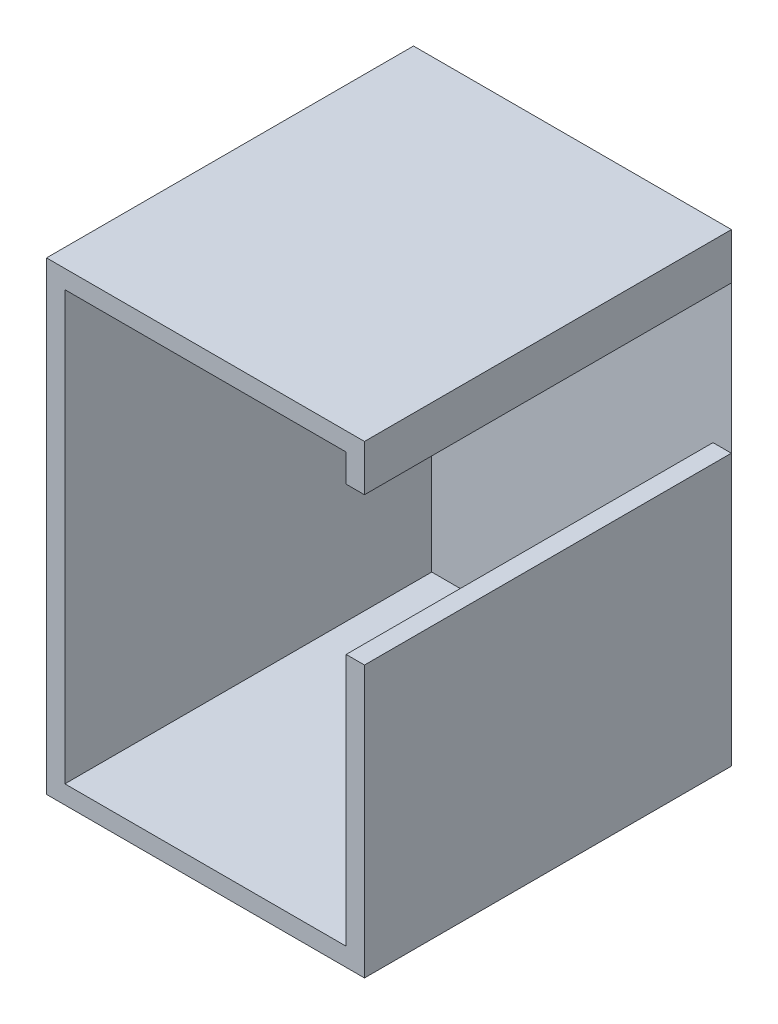
ISO-10303-21;
HEADER;
FILE_DESCRIPTION(('STEP AP214'),'2;1');
FILE_NAME('part.step','',(''),(''),'','','');
FILE_SCHEMA(('AUTOMOTIVE_DESIGN { 1 0 10303 214 1 1 1 1 }'));
ENDSEC;
DATA;
#1=APPLICATION_CONTEXT('core data for automotive mechanical design processes');
#2=APPLICATION_PROTOCOL_DEFINITION('international standard','automotive_design',2000,#1);
#3=PRODUCT_CONTEXT('',#1,'mechanical');
#4=PRODUCT('Part','Part','',(#3));
#5=PRODUCT_RELATED_PRODUCT_CATEGORY('part','',(#4));
#6=PRODUCT_DEFINITION_FORMATION('','',#4);
#7=PRODUCT_DEFINITION_CONTEXT('part definition',#1,'design');
#8=PRODUCT_DEFINITION('design','',#6,#7);
#9=PRODUCT_DEFINITION_SHAPE('','',#8);
#10=(LENGTH_UNIT() NAMED_UNIT(*) SI_UNIT(.MILLI.,.METRE.));
#11=(NAMED_UNIT(*) PLANE_ANGLE_UNIT() SI_UNIT($,.RADIAN.));
#12=(NAMED_UNIT(*) SI_UNIT($,.STERADIAN.) SOLID_ANGLE_UNIT());
#13=UNCERTAINTY_MEASURE_WITH_UNIT(LENGTH_MEASURE(1.E-05),#10,'distance_accuracy_value','');
#14=(GEOMETRIC_REPRESENTATION_CONTEXT(3) GLOBAL_UNCERTAINTY_ASSIGNED_CONTEXT((#13)) GLOBAL_UNIT_ASSIGNED_CONTEXT((#10,
#11,#12)) REPRESENTATION_CONTEXT('',''));
#15=CARTESIAN_POINT('',(0.,0.,0.));
#16=DIRECTION('',(0.,0.,1.));
#17=DIRECTION('',(1.,0.,0.));
#18=AXIS2_PLACEMENT_3D('',#15,#16,#17);
#19=CARTESIAN_POINT('',(0.,0.,3000.));
#20=DIRECTION('',(1.,0.,0.));
#21=DIRECTION('',(0.,1.,0.));
#22=AXIS2_PLACEMENT_3D('',#19,#20,#21);
#23=PLANE('',#22);
#24=DIRECTION('',(0.,-1.,0.));
#25=VECTOR('',#24,1.);
#26=CARTESIAN_POINT('',(0.,0.,0.));
#27=LINE('',#26,#25);
#28=CARTESIAN_POINT('',(0.,0.,0.));
#29=VERTEX_POINT('',#28);
#30=CARTESIAN_POINT('',(0.,-227.614779849119,0.));
#31=VERTEX_POINT('',#30);
#32=EDGE_CURVE('E151',#29,#31,#27,.T.);
#33=ORIENTED_EDGE('',*,*,#32,.T.);
#34=DIRECTION('',(0.,0.,-1.));
#35=VECTOR('',#34,1.);
#36=CARTESIAN_POINT('',(0.,-227.614779849119,3000.));
#37=LINE('',#36,#35);
#38=CARTESIAN_POINT('',(0.,-227.614779849119,3000.));
#39=VERTEX_POINT('',#38);
#40=EDGE_CURVE('E11',#39,#31,#37,.T.);
#41=ORIENTED_EDGE('',*,*,#40,.F.);
#42=DIRECTION('',(0.,-1.,0.));
#43=VECTOR('',#42,1.);
#44=CARTESIAN_POINT('',(0.,0.,3000.));
#45=LINE('',#44,#43);
#46=CARTESIAN_POINT('',(0.,0.,3000.));
#47=VERTEX_POINT('',#46);
#48=EDGE_CURVE('E154',#47,#39,#45,.T.);
#49=ORIENTED_EDGE('',*,*,#48,.F.);
#50=DIRECTION('',(0.,0.,-1.));
#51=VECTOR('',#50,1.);
#52=CARTESIAN_POINT('',(0.,0.,3000.));
#53=LINE('',#52,#51);
#54=EDGE_CURVE('E177',#47,#29,#53,.T.);
#55=ORIENTED_EDGE('',*,*,#54,.T.);
#56=EDGE_LOOP('',(#33,#41,#49,#55));
#57=FACE_BOUND('',#56,.T.);
#58=ADVANCED_FACE('F32',(#57),#23,.F.);
#59=CARTESIAN_POINT('',(0.,-227.614779849119,3000.));
#60=DIRECTION('',(0.,1.,0.));
#61=DIRECTION('',(0.,0.,1.));
#62=AXIS2_PLACEMENT_3D('',#59,#60,#61);
#63=PLANE('',#62);
#64=DIRECTION('',(1.,0.,0.));
#65=VECTOR('',#64,1.);
#66=CARTESIAN_POINT('',(0.,-227.614779849119,0.));
#67=LINE('',#66,#65);
#68=CARTESIAN_POINT('',(150.,-227.614779849119,0.));
#69=VERTEX_POINT('',#68);
#70=EDGE_CURVE('E180',#31,#69,#67,.T.);
#71=ORIENTED_EDGE('',*,*,#70,.T.);
#72=DIRECTION('',(0.,0.,-1.));
#73=VECTOR('',#72,1.);
#74=CARTESIAN_POINT('',(150.,-227.614779849119,3000.));
#75=LINE('',#74,#73);
#76=CARTESIAN_POINT('',(150.,-227.614779849119,3000.));
#77=VERTEX_POINT('',#76);
#78=EDGE_CURVE('E41',#77,#69,#75,.T.);
#79=ORIENTED_EDGE('',*,*,#78,.F.);
#80=DIRECTION('',(1.,0.,0.));
#81=VECTOR('',#80,1.);
#82=CARTESIAN_POINT('',(0.,-227.614779849119,3000.));
#83=LINE('',#82,#81);
#84=EDGE_CURVE('E156',#39,#77,#83,.T.);
#85=ORIENTED_EDGE('',*,*,#84,.F.);
#86=ORIENTED_EDGE('',*,*,#40,.T.);
#87=EDGE_LOOP('',(#71,#79,#85,#86));
#88=FACE_BOUND('',#87,.T.);
#89=ADVANCED_FACE('F256',(#88),#63,.F.);
#90=CARTESIAN_POINT('',(150.,150.,3000.));
#91=DIRECTION('',(0.,-1.,0.));
#92=DIRECTION('',(1.,0.,0.));
#93=AXIS2_PLACEMENT_3D('',#90,#91,#92);
#94=PLANE('',#93);
#95=DIRECTION('',(0.,0.,-1.));
#96=VECTOR('',#95,1.);
#97=CARTESIAN_POINT('',(150.,150.,3000.));
#98=LINE('',#97,#96);
#99=CARTESIAN_POINT('',(150.,150.,3000.));
#100=VERTEX_POINT('',#99);
#101=CARTESIAN_POINT('',(150.,150.,-1.));
#102=VERTEX_POINT('',#101);
#103=EDGE_CURVE('E128',#100,#102,#98,.T.);
#104=ORIENTED_EDGE('',*,*,#103,.T.);
#105=DIRECTION('',(1.,0.,0.));
#106=VECTOR('',#105,1.);
#107=CARTESIAN_POINT('',(-2450.,150.,-1.));
#108=LINE('',#107,#106);
#109=CARTESIAN_POINT('',(-2450.,150.,-1.));
#110=VERTEX_POINT('',#109);
#111=EDGE_CURVE('E132',#110,#102,#108,.T.);
#112=ORIENTED_EDGE('',*,*,#111,.F.);
#113=DIRECTION('',(0.,0.,-1.));
#114=VECTOR('',#113,1.);
#115=CARTESIAN_POINT('',(-2450.,150.,3000.));
#116=LINE('',#115,#114);
#117=CARTESIAN_POINT('',(-2450.,150.,3000.));
#118=VERTEX_POINT('',#117);
#119=EDGE_CURVE('E119',#118,#110,#116,.T.);
#120=ORIENTED_EDGE('',*,*,#119,.F.);
#121=DIRECTION('',(-1.,0.,0.));
#122=VECTOR('',#121,1.);
#123=CARTESIAN_POINT('',(150.,150.,3000.));
#124=LINE('',#123,#122);
#125=EDGE_CURVE('E161',#100,#118,#124,.T.);
#126=ORIENTED_EDGE('',*,*,#125,.F.);
#127=EDGE_LOOP('',(#104,#112,#120,#126));
#128=FACE_BOUND('',#127,.T.);
#129=ADVANCED_FACE('F133',(#128),#94,.F.);
#130=CARTESIAN_POINT('',(-2450.,150.,3000.));
#131=DIRECTION('',(1.,0.,0.));
#132=DIRECTION('',(0.,1.,0.));
#133=AXIS2_PLACEMENT_3D('',#130,#131,#132);
#134=PLANE('',#133);
#135=ORIENTED_EDGE('',*,*,#119,.T.);
#136=DIRECTION('',(0.,1.,0.));
#137=VECTOR('',#136,1.);
#138=CARTESIAN_POINT('',(-2450.,-3650.,-1.));
#139=LINE('',#138,#137);
#140=CARTESIAN_POINT('',(-2450.,-3650.,-1.));
#141=VERTEX_POINT('',#140);
#142=EDGE_CURVE('E124',#141,#110,#139,.T.);
#143=ORIENTED_EDGE('',*,*,#142,.F.);
#144=DIRECTION('',(0.,0.,-1.));
#145=VECTOR('',#144,1.);
#146=CARTESIAN_POINT('',(-2450.,-3650.,3000.));
#147=LINE('',#146,#145);
#148=CARTESIAN_POINT('',(-2450.,-3650.,3000.));
#149=VERTEX_POINT('',#148);
#150=EDGE_CURVE('E129',#149,#141,#147,.T.);
#151=ORIENTED_EDGE('',*,*,#150,.F.);
#152=DIRECTION('',(0.,-1.,0.));
#153=VECTOR('',#152,1.);
#154=CARTESIAN_POINT('',(-2450.,150.,3000.));
#155=LINE('',#154,#153);
#156=EDGE_CURVE('E125',#118,#149,#155,.T.);
#157=ORIENTED_EDGE('',*,*,#156,.F.);
#158=EDGE_LOOP('',(#135,#143,#151,#157));
#159=FACE_BOUND('',#158,.T.);
#160=ADVANCED_FACE('F121',(#159),#134,.F.);
#161=CARTESIAN_POINT('',(150.,-3650.,3000.));
#162=DIRECTION('',(0.,1.,0.));
#163=DIRECTION('',(-1.,0.,0.));
#164=AXIS2_PLACEMENT_3D('',#161,#162,#163);
#165=PLANE('',#164);
#166=ORIENTED_EDGE('',*,*,#150,.T.);
#167=DIRECTION('',(-1.,0.,0.));
#168=VECTOR('',#167,1.);
#169=CARTESIAN_POINT('',(-2450.,-3650.,-1.));
#170=LINE('',#169,#168);
#171=CARTESIAN_POINT('',(150.,-3650.,-1.));
#172=VERTEX_POINT('',#171);
#173=EDGE_CURVE('E143',#172,#141,#170,.T.);
#174=ORIENTED_EDGE('',*,*,#173,.F.);
#175=DIRECTION('',(0.,0.,-1.));
#176=VECTOR('',#175,1.);
#177=CARTESIAN_POINT('',(150.,-3650.,3000.));
#178=LINE('',#177,#176);
#179=CARTESIAN_POINT('',(150.,-3650.,3000.));
#180=VERTEX_POINT('',#179);
#181=EDGE_CURVE('E199',#180,#172,#178,.T.);
#182=ORIENTED_EDGE('',*,*,#181,.F.);
#183=DIRECTION('',(1.,0.,0.));
#184=VECTOR('',#183,1.);
#185=CARTESIAN_POINT('',(150.,-3650.,3000.));
#186=LINE('',#185,#184);
#187=EDGE_CURVE('E164',#149,#180,#186,.T.);
#188=ORIENTED_EDGE('',*,*,#187,.F.);
#189=EDGE_LOOP('',(#166,#174,#182,#188));
#190=FACE_BOUND('',#189,.T.);
#191=ADVANCED_FACE('F219',(#190),#165,.F.);
#192=CARTESIAN_POINT('',(150.,-1433.3365102259,3000.));
#193=DIRECTION('',(-1.,0.,0.));
#194=DIRECTION('',(0.,-1.,0.));
#195=AXIS2_PLACEMENT_3D('',#192,#193,#194);
#196=PLANE('',#195);
#197=ORIENTED_EDGE('',*,*,#181,.T.);
#198=DIRECTION('',(0.,-1.,0.));
#199=VECTOR('',#198,1.);
#200=CARTESIAN_POINT('',(150.,-3650.,-1.));
#201=LINE('',#200,#199);
#202=EDGE_CURVE('E138',#102,#172,#201,.T.);
#203=ORIENTED_EDGE('',*,*,#202,.F.);
#204=ORIENTED_EDGE('',*,*,#103,.F.);
#205=DIRECTION('',(0.,1.,0.));
#206=VECTOR('',#205,1.);
#207=CARTESIAN_POINT('',(150.,150.,3000.));
#208=LINE('',#207,#206);
#209=EDGE_CURVE('E159',#77,#100,#208,.T.);
#210=ORIENTED_EDGE('',*,*,#209,.F.);
#211=ORIENTED_EDGE('',*,*,#78,.T.);
#212=DIRECTION('',(0.,-1.,0.));
#213=VECTOR('',#212,1.);
#214=CARTESIAN_POINT('',(150.,-3650.,0.));
#215=LINE('',#214,#213);
#216=CARTESIAN_POINT('',(150.,-1433.3365102259,0.));
#217=VERTEX_POINT('',#216);
#218=EDGE_CURVE('E144',#69,#217,#215,.T.);
#219=ORIENTED_EDGE('',*,*,#218,.T.);
#220=DIRECTION('',(0.,0.,-1.));
#221=VECTOR('',#220,1.);
#222=CARTESIAN_POINT('',(150.,-1433.3365102259,3000.));
#223=LINE('',#222,#221);
#224=CARTESIAN_POINT('',(150.,-1433.3365102259,3000.));
#225=VERTEX_POINT('',#224);
#226=EDGE_CURVE('E197',#225,#217,#223,.T.);
#227=ORIENTED_EDGE('',*,*,#226,.F.);
#228=DIRECTION('',(0.,1.,0.));
#229=VECTOR('',#228,1.);
#230=CARTESIAN_POINT('',(150.,-1433.3365102259,3000.));
#231=LINE('',#230,#229);
#232=EDGE_CURVE('E166',#180,#225,#231,.T.);
#233=ORIENTED_EDGE('',*,*,#232,.F.);
#234=EDGE_LOOP('',(#197,#203,#204,#210,#211,#219,#227,#233));
#235=FACE_BOUND('',#234,.T.);
#236=ADVANCED_FACE('F226',(#235),#196,.F.);
#237=CARTESIAN_POINT('',(150.,-1433.3365102259,3000.));
#238=DIRECTION('',(0.,-1.,0.));
#239=DIRECTION('',(0.,0.,-1.));
#240=AXIS2_PLACEMENT_3D('',#237,#238,#239);
#241=PLANE('',#240);
#242=DIRECTION('',(-1.,0.,0.));
#243=VECTOR('',#242,1.);
#244=CARTESIAN_POINT('',(150.,-1433.3365102259,0.));
#245=LINE('',#244,#243);
#246=CARTESIAN_POINT('',(0.,-1433.3365102259,0.));
#247=VERTEX_POINT('',#246);
#248=EDGE_CURVE('E188',#217,#247,#245,.T.);
#249=ORIENTED_EDGE('',*,*,#248,.T.);
#250=DIRECTION('',(0.,0.,-1.));
#251=VECTOR('',#250,1.);
#252=CARTESIAN_POINT('',(0.,-1433.3365102259,3000.));
#253=LINE('',#252,#251);
#254=CARTESIAN_POINT('',(0.,-1433.3365102259,3000.));
#255=VERTEX_POINT('',#254);
#256=EDGE_CURVE('E200',#255,#247,#253,.T.);
#257=ORIENTED_EDGE('',*,*,#256,.F.);
#258=DIRECTION('',(-1.,0.,0.));
#259=VECTOR('',#258,1.);
#260=CARTESIAN_POINT('',(150.,-1433.3365102259,3000.));
#261=LINE('',#260,#259);
#262=EDGE_CURVE('E168',#225,#255,#261,.T.);
#263=ORIENTED_EDGE('',*,*,#262,.F.);
#264=ORIENTED_EDGE('',*,*,#226,.T.);
#265=EDGE_LOOP('',(#249,#257,#263,#264));
#266=FACE_BOUND('',#265,.T.);
#267=ADVANCED_FACE('F228',(#266),#241,.F.);
#268=CARTESIAN_POINT('',(0.,-1433.3365102259,3000.));
#269=DIRECTION('',(1.,0.,0.));
#270=DIRECTION('',(0.,1.,0.));
#271=AXIS2_PLACEMENT_3D('',#268,#269,#270);
#272=PLANE('',#271);
#273=DIRECTION('',(0.,-1.,0.));
#274=VECTOR('',#273,1.);
#275=CARTESIAN_POINT('',(0.,-1433.3365102259,0.));
#276=LINE('',#275,#274);
#277=CARTESIAN_POINT('',(0.,-3500.,0.));
#278=VERTEX_POINT('',#277);
#279=EDGE_CURVE('E183',#247,#278,#276,.T.);
#280=ORIENTED_EDGE('',*,*,#279,.T.);
#281=DIRECTION('',(0.,0.,-1.));
#282=VECTOR('',#281,1.);
#283=CARTESIAN_POINT('',(0.,-3500.,3000.));
#284=LINE('',#283,#282);
#285=CARTESIAN_POINT('',(0.,-3500.,3000.));
#286=VERTEX_POINT('',#285);
#287=EDGE_CURVE('E206',#286,#278,#284,.T.);
#288=ORIENTED_EDGE('',*,*,#287,.F.);
#289=DIRECTION('',(0.,-1.,0.));
#290=VECTOR('',#289,1.);
#291=CARTESIAN_POINT('',(0.,-1433.3365102259,3000.));
#292=LINE('',#291,#290);
#293=EDGE_CURVE('E170',#255,#286,#292,.T.);
#294=ORIENTED_EDGE('',*,*,#293,.F.);
#295=ORIENTED_EDGE('',*,*,#256,.T.);
#296=EDGE_LOOP('',(#280,#288,#294,#295));
#297=FACE_BOUND('',#296,.T.);
#298=ADVANCED_FACE('F232',(#297),#272,.F.);
#299=CARTESIAN_POINT('',(0.,-3500.,3000.));
#300=DIRECTION('',(0.,-1.,0.));
#301=DIRECTION('',(1.,0.,0.));
#302=AXIS2_PLACEMENT_3D('',#299,#300,#301);
#303=PLANE('',#302);
#304=DIRECTION('',(-1.,0.,0.));
#305=VECTOR('',#304,1.);
#306=CARTESIAN_POINT('',(0.,-3500.,0.));
#307=LINE('',#306,#305);
#308=CARTESIAN_POINT('',(-2300.,-3500.,0.));
#309=VERTEX_POINT('',#308);
#310=EDGE_CURVE('E238',#278,#309,#307,.T.);
#311=ORIENTED_EDGE('',*,*,#310,.T.);
#312=DIRECTION('',(0.,0.,-1.));
#313=VECTOR('',#312,1.);
#314=CARTESIAN_POINT('',(-2300.,-3500.,3000.));
#315=LINE('',#314,#313);
#316=CARTESIAN_POINT('',(-2300.,-3500.,3000.));
#317=VERTEX_POINT('',#316);
#318=EDGE_CURVE('E213',#317,#309,#315,.T.);
#319=ORIENTED_EDGE('',*,*,#318,.F.);
#320=DIRECTION('',(-1.,0.,0.));
#321=VECTOR('',#320,1.);
#322=CARTESIAN_POINT('',(0.,-3500.,3000.));
#323=LINE('',#322,#321);
#324=EDGE_CURVE('E172',#286,#317,#323,.T.);
#325=ORIENTED_EDGE('',*,*,#324,.F.);
#326=ORIENTED_EDGE('',*,*,#287,.T.);
#327=EDGE_LOOP('',(#311,#319,#325,#326));
#328=FACE_BOUND('',#327,.T.);
#329=ADVANCED_FACE('F235',(#328),#303,.F.);
#330=CARTESIAN_POINT('',(-2300.,-2.81668763803891E-13,3000.));
#331=DIRECTION('',(-1.,0.,0.));
#332=DIRECTION('',(0.,0.,1.));
#333=AXIS2_PLACEMENT_3D('',#330,#331,#332);
#334=PLANE('',#333);
#335=DIRECTION('',(0.,1.,0.));
#336=VECTOR('',#335,1.);
#337=CARTESIAN_POINT('',(-2300.,-2.81668763803891E-13,0.));
#338=LINE('',#337,#336);
#339=CARTESIAN_POINT('',(-2300.,-2.81668763803891E-13,0.));
#340=VERTEX_POINT('',#339);
#341=EDGE_CURVE('E245',#309,#340,#338,.T.);
#342=ORIENTED_EDGE('',*,*,#341,.T.);
#343=DIRECTION('',(0.,0.,-1.));
#344=VECTOR('',#343,1.);
#345=CARTESIAN_POINT('',(-2300.,-2.81668763803891E-13,3000.));
#346=LINE('',#345,#344);
#347=CARTESIAN_POINT('',(-2300.,-2.81668763803891E-13,3000.));
#348=VERTEX_POINT('',#347);
#349=EDGE_CURVE('E241',#348,#340,#346,.T.);
#350=ORIENTED_EDGE('',*,*,#349,.F.);
#351=DIRECTION('',(0.,1.,0.));
#352=VECTOR('',#351,1.);
#353=CARTESIAN_POINT('',(-2300.,-2.81668763803891E-13,3000.));
#354=LINE('',#353,#352);
#355=EDGE_CURVE('E174',#317,#348,#354,.T.);
#356=ORIENTED_EDGE('',*,*,#355,.F.);
#357=ORIENTED_EDGE('',*,*,#318,.T.);
#358=EDGE_LOOP('',(#342,#350,#356,#357));
#359=FACE_BOUND('',#358,.T.);
#360=ADVANCED_FACE('F243',(#359),#334,.F.);
#361=CARTESIAN_POINT('',(0.,0.,3000.));
#362=DIRECTION('',(0.,1.,0.));
#363=DIRECTION('',(-1.,0.,0.));
#364=AXIS2_PLACEMENT_3D('',#361,#362,#363);
#365=PLANE('',#364);
#366=DIRECTION('',(1.,0.,0.));
#367=VECTOR('',#366,1.);
#368=CARTESIAN_POINT('',(0.,0.,0.));
#369=LINE('',#368,#367);
#370=EDGE_CURVE('E157',#340,#29,#369,.T.);
#371=ORIENTED_EDGE('',*,*,#370,.T.);
#372=ORIENTED_EDGE('',*,*,#54,.F.);
#373=DIRECTION('',(1.,0.,0.));
#374=VECTOR('',#373,1.);
#375=CARTESIAN_POINT('',(0.,0.,3000.));
#376=LINE('',#375,#374);
#377=EDGE_CURVE('E49',#348,#47,#376,.T.);
#378=ORIENTED_EDGE('',*,*,#377,.F.);
#379=ORIENTED_EDGE('',*,*,#349,.T.);
#380=EDGE_LOOP('',(#371,#372,#378,#379));
#381=FACE_BOUND('',#380,.T.);
#382=ADVANCED_FACE('F249',(#381),#365,.F.);
#383=CARTESIAN_POINT('',(0.,0.,3000.));
#384=DIRECTION('',(0.,0.,1.));
#385=DIRECTION('',(1.,0.,0.));
#386=AXIS2_PLACEMENT_3D('',#383,#384,#385);
#387=PLANE('',#386);
#388=ORIENTED_EDGE('',*,*,#48,.T.);
#389=ORIENTED_EDGE('',*,*,#84,.T.);
#390=ORIENTED_EDGE('',*,*,#209,.T.);
#391=ORIENTED_EDGE('',*,*,#125,.T.);
#392=ORIENTED_EDGE('',*,*,#156,.T.);
#393=ORIENTED_EDGE('',*,*,#187,.T.);
#394=ORIENTED_EDGE('',*,*,#232,.T.);
#395=ORIENTED_EDGE('',*,*,#262,.T.);
#396=ORIENTED_EDGE('',*,*,#293,.T.);
#397=ORIENTED_EDGE('',*,*,#324,.T.);
#398=ORIENTED_EDGE('',*,*,#355,.T.);
#399=ORIENTED_EDGE('',*,*,#377,.T.);
#400=EDGE_LOOP('',(#388,#389,#390,#391,#392,#393,#394,#395,#396,#397,#398,#399));
#401=FACE_BOUND('',#400,.T.);
#402=ADVANCED_FACE('F222',(#401),#387,.T.);
#403=CARTESIAN_POINT('',(0.,0.,-1.));
#404=DIRECTION('',(0.,0.,-1.));
#405=DIRECTION('',(-1.,0.,0.));
#406=AXIS2_PLACEMENT_3D('',#403,#404,#405);
#407=PLANE('',#406);
#408=ORIENTED_EDGE('',*,*,#142,.T.);
#409=ORIENTED_EDGE('',*,*,#111,.T.);
#410=ORIENTED_EDGE('',*,*,#202,.T.);
#411=ORIENTED_EDGE('',*,*,#173,.T.);
#412=EDGE_LOOP('',(#408,#409,#410,#411));
#413=FACE_BOUND('',#412,.T.);
#414=ADVANCED_FACE('F141',(#413),#407,.T.);
#415=CARTESIAN_POINT('',(0.,0.,0.));
#416=DIRECTION('',(0.,0.,-1.));
#417=DIRECTION('',(-1.,0.,0.));
#418=AXIS2_PLACEMENT_3D('',#415,#416,#417);
#419=PLANE('',#418);
#420=ORIENTED_EDGE('',*,*,#248,.F.);
#421=ORIENTED_EDGE('',*,*,#218,.F.);
#422=ORIENTED_EDGE('',*,*,#70,.F.);
#423=ORIENTED_EDGE('',*,*,#32,.F.);
#424=ORIENTED_EDGE('',*,*,#370,.F.);
#425=ORIENTED_EDGE('',*,*,#341,.F.);
#426=ORIENTED_EDGE('',*,*,#310,.F.);
#427=ORIENTED_EDGE('',*,*,#279,.F.);
#428=EDGE_LOOP('',(#420,#421,#422,#423,#424,#425,#426,#427));
#429=FACE_BOUND('',#428,.T.);
#430=ADVANCED_FACE('F258',(#429),#419,.F.);
#431=CLOSED_SHELL('',(#58,#89,#129,#160,#191,#236,#267,#298,#329,#360,#382,#402,#414,#430));
#432=MANIFOLD_SOLID_BREP('B2',#431);
#433=ADVANCED_BREP_SHAPE_REPRESENTATION('',(#18,#432),#14);
#434=SHAPE_DEFINITION_REPRESENTATION(#9,#433);
ENDSEC;
END-ISO-10303-21;
